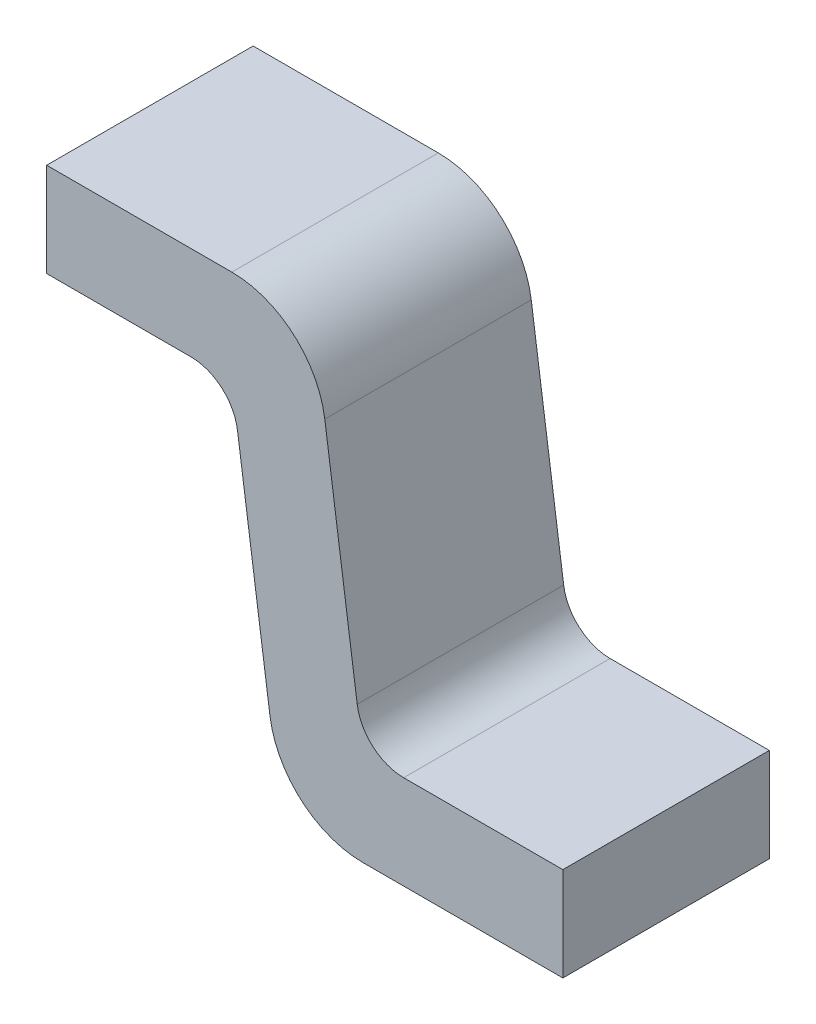
ISO-10303-21;
HEADER;
FILE_DESCRIPTION(('STEP AP214'),'2;1');
FILE_NAME('part.step','',(''),(''),'','','');
FILE_SCHEMA(('AUTOMOTIVE_DESIGN { 1 0 10303 214 1 1 1 1 }'));
ENDSEC;
DATA;
#1=APPLICATION_CONTEXT('core data for automotive mechanical design processes');
#2=APPLICATION_PROTOCOL_DEFINITION('international standard','automotive_design',2000,#1);
#3=PRODUCT_CONTEXT('',#1,'mechanical');
#4=PRODUCT('Part','Part','',(#3));
#5=PRODUCT_RELATED_PRODUCT_CATEGORY('part','',(#4));
#6=PRODUCT_DEFINITION_FORMATION('','',#4);
#7=PRODUCT_DEFINITION_CONTEXT('part definition',#1,'design');
#8=PRODUCT_DEFINITION('design','',#6,#7);
#9=PRODUCT_DEFINITION_SHAPE('','',#8);
#10=(LENGTH_UNIT() NAMED_UNIT(*) SI_UNIT(.MILLI.,.METRE.));
#11=(NAMED_UNIT(*) PLANE_ANGLE_UNIT() SI_UNIT($,.RADIAN.));
#12=(NAMED_UNIT(*) SI_UNIT($,.STERADIAN.) SOLID_ANGLE_UNIT());
#13=UNCERTAINTY_MEASURE_WITH_UNIT(LENGTH_MEASURE(1.E-05),#10,'distance_accuracy_value','');
#14=(GEOMETRIC_REPRESENTATION_CONTEXT(3) GLOBAL_UNCERTAINTY_ASSIGNED_CONTEXT((#13)) GLOBAL_UNIT_ASSIGNED_CONTEXT((#10,
#11,#12)) REPRESENTATION_CONTEXT('',''));
#15=CARTESIAN_POINT('',(0.,0.,0.));
#16=DIRECTION('',(0.,0.,1.));
#17=DIRECTION('',(1.,0.,0.));
#18=AXIS2_PLACEMENT_3D('',#15,#16,#17);
#19=CARTESIAN_POINT('',(1.1,0.,-0.22));
#20=DIRECTION('',(1.,0.,0.));
#21=DIRECTION('',(0.,0.,-1.));
#22=AXIS2_PLACEMENT_3D('',#19,#20,#21);
#23=PLANE('',#22);
#24=DIRECTION('',(0.,0.,1.));
#25=VECTOR('',#24,1.);
#26=CARTESIAN_POINT('',(1.1,0.2,-0.22));
#27=LINE('',#26,#25);
#28=CARTESIAN_POINT('',(1.1,0.2,-0.22));
#29=VERTEX_POINT('',#28);
#30=CARTESIAN_POINT('',(1.1,0.2,0.22));
#31=VERTEX_POINT('',#30);
#32=EDGE_CURVE('E39',#29,#31,#27,.T.);
#33=ORIENTED_EDGE('',*,*,#32,.T.);
#34=DIRECTION('',(0.,1.,0.));
#35=VECTOR('',#34,1.);
#36=CARTESIAN_POINT('',(1.1,0.,0.22));
#37=LINE('',#36,#35);
#38=CARTESIAN_POINT('',(1.1,0.,0.22));
#39=VERTEX_POINT('',#38);
#40=EDGE_CURVE('E124',#39,#31,#37,.T.);
#41=ORIENTED_EDGE('',*,*,#40,.F.);
#42=DIRECTION('',(0.,0.,1.));
#43=VECTOR('',#42,1.);
#44=CARTESIAN_POINT('',(1.1,0.,-0.22));
#45=LINE('',#44,#43);
#46=CARTESIAN_POINT('',(1.1,0.,-0.22));
#47=VERTEX_POINT('',#46);
#48=EDGE_CURVE('E11',#47,#39,#45,.T.);
#49=ORIENTED_EDGE('',*,*,#48,.F.);
#50=DIRECTION('',(0.,1.,0.));
#51=VECTOR('',#50,1.);
#52=CARTESIAN_POINT('',(1.1,0.,-0.22));
#53=LINE('',#52,#51);
#54=EDGE_CURVE('E125',#47,#29,#53,.T.);
#55=ORIENTED_EDGE('',*,*,#54,.T.);
#56=EDGE_LOOP('',(#33,#41,#49,#55));
#57=FACE_BOUND('',#56,.T.);
#58=ADVANCED_FACE('F36',(#57),#23,.T.);
#59=CARTESIAN_POINT('',(0.673857347563247,0.,-0.22));
#60=DIRECTION('',(0.,-1.,0.));
#61=DIRECTION('',(1.,0.,0.));
#62=AXIS2_PLACEMENT_3D('',#59,#60,#61);
#63=PLANE('',#62);
#64=ORIENTED_EDGE('',*,*,#48,.T.);
#65=DIRECTION('',(1.,0.,0.));
#66=VECTOR('',#65,1.);
#67=CARTESIAN_POINT('',(0.673857347563247,0.,0.22));
#68=LINE('',#67,#66);
#69=CARTESIAN_POINT('',(0.673857347563247,0.,0.22));
#70=VERTEX_POINT('',#69);
#71=EDGE_CURVE('E142',#70,#39,#68,.T.);
#72=ORIENTED_EDGE('',*,*,#71,.F.);
#73=DIRECTION('',(0.,0.,1.));
#74=VECTOR('',#73,1.);
#75=CARTESIAN_POINT('',(0.673857347563247,0.,-0.22));
#76=LINE('',#75,#74);
#77=CARTESIAN_POINT('',(0.673857347563247,0.,-0.22));
#78=VERTEX_POINT('',#77);
#79=EDGE_CURVE('E44',#78,#70,#76,.T.);
#80=ORIENTED_EDGE('',*,*,#79,.F.);
#81=DIRECTION('',(1.,0.,0.));
#82=VECTOR('',#81,1.);
#83=CARTESIAN_POINT('',(0.673857347563247,0.,-0.22));
#84=LINE('',#83,#82);
#85=EDGE_CURVE('E130',#78,#47,#84,.T.);
#86=ORIENTED_EDGE('',*,*,#85,.T.);
#87=EDGE_LOOP('',(#64,#72,#80,#86));
#88=FACE_BOUND('',#87,.T.);
#89=ADVANCED_FACE('F254',(#88),#63,.T.);
#90=CARTESIAN_POINT('',(0.673857347563247,0.2,-0.22));
#91=DIRECTION('',(0.,0.,1.));
#92=DIRECTION('',(1.,0.,0.));
#93=AXIS2_PLACEMENT_3D('',#90,#91,#92);
#94=CYLINDRICAL_SURFACE('',#93,0.2);
#95=ORIENTED_EDGE('',*,*,#79,.T.);
#96=CARTESIAN_POINT('',(0.673857347563247,0.2,0.22));
#97=DIRECTION('',(0.,0.,1.));
#98=DIRECTION('',(1.,0.,0.));
#99=AXIS2_PLACEMENT_3D('',#96,#97,#98);
#100=CIRCLE('',#99,0.2);
#101=CARTESIAN_POINT('',(0.475803733814932,0.172165379807988,0.22));
#102=VERTEX_POINT('',#101);
#103=EDGE_CURVE('E167',#102,#70,#100,.T.);
#104=ORIENTED_EDGE('',*,*,#103,.F.);
#105=DIRECTION('',(0.,0.,1.));
#106=VECTOR('',#105,1.);
#107=CARTESIAN_POINT('',(0.475803733814932,0.172165379807988,-0.22));
#108=LINE('',#107,#106);
#109=CARTESIAN_POINT('',(0.475803733814932,0.172165379807988,-0.22));
#110=VERTEX_POINT('',#109);
#111=EDGE_CURVE('E201',#110,#102,#108,.T.);
#112=ORIENTED_EDGE('',*,*,#111,.F.);
#113=CARTESIAN_POINT('',(0.673857347563247,0.2,-0.22));
#114=DIRECTION('',(0.,0.,1.));
#115=DIRECTION('',(1.,0.,0.));
#116=AXIS2_PLACEMENT_3D('',#113,#114,#115);
#117=CIRCLE('',#116,0.2);
#118=EDGE_CURVE('E197',#110,#78,#117,.T.);
#119=ORIENTED_EDGE('',*,*,#118,.T.);
#120=EDGE_LOOP('',(#95,#104,#112,#119));
#121=FACE_BOUND('',#120,.T.);
#122=ADVANCED_FACE('F252',(#121),#94,.T.);
#123=CARTESIAN_POINT('',(0.475803733814932,0.172165379807988,-0.22));
#124=DIRECTION('',(-0.990268068741571,-0.139173100960059,0.));
#125=DIRECTION('',(0.139173100960059,-0.990268068741571,0.));
#126=AXIS2_PLACEMENT_3D('',#123,#124,#125);
#127=PLANE('',#126);
#128=ORIENTED_EDGE('',*,*,#111,.T.);
#129=DIRECTION('',(0.139173100960059,-0.990268068741571,0.));
#130=VECTOR('',#129,1.);
#131=CARTESIAN_POINT('',(0.475803733814932,0.172165379807988,0.22));
#132=LINE('',#131,#130);
#133=CARTESIAN_POINT('',(0.406692507065746,0.663917310096006,0.22));
#134=VERTEX_POINT('',#133);
#135=EDGE_CURVE('E164',#134,#102,#132,.T.);
#136=ORIENTED_EDGE('',*,*,#135,.F.);
#137=DIRECTION('',(0.,0.,1.));
#138=VECTOR('',#137,1.);
#139=CARTESIAN_POINT('',(0.406692507065746,0.663917310096006,-0.22));
#140=LINE('',#139,#138);
#141=CARTESIAN_POINT('',(0.406692507065746,0.663917310096006,-0.22));
#142=VERTEX_POINT('',#141);
#143=EDGE_CURVE('E203',#142,#134,#140,.T.);
#144=ORIENTED_EDGE('',*,*,#143,.F.);
#145=DIRECTION('',(0.139173100960059,-0.990268068741571,0.));
#146=VECTOR('',#145,1.);
#147=CARTESIAN_POINT('',(0.475803733814932,0.172165379807988,-0.22));
#148=LINE('',#147,#146);
#149=EDGE_CURVE('E194',#142,#110,#148,.T.);
#150=ORIENTED_EDGE('',*,*,#149,.T.);
#151=EDGE_LOOP('',(#128,#136,#144,#150));
#152=FACE_BOUND('',#151,.T.);
#153=ADVANCED_FACE('F250',(#152),#127,.T.);
#154=CARTESIAN_POINT('',(0.307665700191588,0.65,-0.22));
#155=DIRECTION('',(0.,0.,1.));
#156=DIRECTION('',(1.,0.,0.));
#157=AXIS2_PLACEMENT_3D('',#154,#155,#156);
#158=CYLINDRICAL_SURFACE('',#157,0.1);
#159=ORIENTED_EDGE('',*,*,#143,.T.);
#160=CARTESIAN_POINT('',(0.307665700191588,0.65,0.22));
#161=DIRECTION('',(0.,0.,-1.));
#162=DIRECTION('',(-1.,0.,0.));
#163=AXIS2_PLACEMENT_3D('',#160,#161,#162);
#164=CIRCLE('',#163,0.1);
#165=CARTESIAN_POINT('',(0.307665700191588,0.75,0.22));
#166=VERTEX_POINT('',#165);
#167=EDGE_CURVE('E161',#166,#134,#164,.T.);
#168=ORIENTED_EDGE('',*,*,#167,.F.);
#169=DIRECTION('',(0.,0.,1.));
#170=VECTOR('',#169,1.);
#171=CARTESIAN_POINT('',(0.307665700191588,0.75,-0.22));
#172=LINE('',#171,#170);
#173=CARTESIAN_POINT('',(0.307665700191588,0.75,-0.22));
#174=VERTEX_POINT('',#173);
#175=EDGE_CURVE('E205',#174,#166,#172,.T.);
#176=ORIENTED_EDGE('',*,*,#175,.F.);
#177=CARTESIAN_POINT('',(0.307665700191588,0.65,-0.22));
#178=DIRECTION('',(0.,0.,-1.));
#179=DIRECTION('',(-1.,0.,0.));
#180=AXIS2_PLACEMENT_3D('',#177,#178,#179);
#181=CIRCLE('',#180,0.1);
#182=EDGE_CURVE('E191',#174,#142,#181,.T.);
#183=ORIENTED_EDGE('',*,*,#182,.T.);
#184=EDGE_LOOP('',(#159,#168,#176,#183));
#185=FACE_BOUND('',#184,.T.);
#186=ADVANCED_FACE('F245',(#185),#158,.F.);
#187=CARTESIAN_POINT('',(0.307665700191588,0.75,-0.22));
#188=DIRECTION('',(0.,-1.,0.));
#189=DIRECTION('',(0.,0.,-1.));
#190=AXIS2_PLACEMENT_3D('',#187,#188,#189);
#191=PLANE('',#190);
#192=ORIENTED_EDGE('',*,*,#175,.T.);
#193=DIRECTION('',(1.,0.,0.));
#194=VECTOR('',#193,1.);
#195=CARTESIAN_POINT('',(0.307665700191588,0.75,0.22));
#196=LINE('',#195,#194);
#197=CARTESIAN_POINT('',(0.,0.75,0.22));
#198=VERTEX_POINT('',#197);
#199=EDGE_CURVE('E158',#198,#166,#196,.T.);
#200=ORIENTED_EDGE('',*,*,#199,.F.);
#201=DIRECTION('',(0.,0.,1.));
#202=VECTOR('',#201,1.);
#203=CARTESIAN_POINT('',(0.,0.75,-0.22));
#204=LINE('',#203,#202);
#205=CARTESIAN_POINT('',(0.,0.75,-0.22));
#206=VERTEX_POINT('',#205);
#207=EDGE_CURVE('E207',#206,#198,#204,.T.);
#208=ORIENTED_EDGE('',*,*,#207,.F.);
#209=DIRECTION('',(1.,0.,0.));
#210=VECTOR('',#209,1.);
#211=CARTESIAN_POINT('',(0.307665700191588,0.75,-0.22));
#212=LINE('',#211,#210);
#213=EDGE_CURVE('E188',#206,#174,#212,.T.);
#214=ORIENTED_EDGE('',*,*,#213,.T.);
#215=EDGE_LOOP('',(#192,#200,#208,#214));
#216=FACE_BOUND('',#215,.T.);
#217=ADVANCED_FACE('F240',(#216),#191,.T.);
#218=CARTESIAN_POINT('',(0.,0.95,-0.22));
#219=DIRECTION('',(-1.,0.,0.));
#220=DIRECTION('',(0.,-1.,0.));
#221=AXIS2_PLACEMENT_3D('',#218,#219,#220);
#222=PLANE('',#221);
#223=ORIENTED_EDGE('',*,*,#207,.T.);
#224=DIRECTION('',(0.,-1.,0.));
#225=VECTOR('',#224,1.);
#226=CARTESIAN_POINT('',(0.,0.95,0.22));
#227=LINE('',#226,#225);
#228=CARTESIAN_POINT('',(0.,0.95,0.22));
#229=VERTEX_POINT('',#228);
#230=EDGE_CURVE('E155',#229,#198,#227,.T.);
#231=ORIENTED_EDGE('',*,*,#230,.F.);
#232=DIRECTION('',(0.,0.,1.));
#233=VECTOR('',#232,1.);
#234=CARTESIAN_POINT('',(0.,0.95,-0.22));
#235=LINE('',#234,#233);
#236=CARTESIAN_POINT('',(0.,0.95,-0.22));
#237=VERTEX_POINT('',#236);
#238=EDGE_CURVE('E209',#237,#229,#235,.T.);
#239=ORIENTED_EDGE('',*,*,#238,.F.);
#240=DIRECTION('',(0.,-1.,0.));
#241=VECTOR('',#240,1.);
#242=CARTESIAN_POINT('',(0.,0.95,-0.22));
#243=LINE('',#242,#241);
#244=EDGE_CURVE('E185',#237,#206,#243,.T.);
#245=ORIENTED_EDGE('',*,*,#244,.T.);
#246=EDGE_LOOP('',(#223,#231,#239,#245));
#247=FACE_BOUND('',#246,.T.);
#248=ADVANCED_FACE('F238',(#247),#222,.T.);
#249=CARTESIAN_POINT('',(0.,0.95,-0.22));
#250=DIRECTION('',(0.,1.,0.));
#251=DIRECTION('',(-1.,0.,0.));
#252=AXIS2_PLACEMENT_3D('',#249,#250,#251);
#253=PLANE('',#252);
#254=ORIENTED_EDGE('',*,*,#238,.T.);
#255=DIRECTION('',(-1.,0.,0.));
#256=VECTOR('',#255,1.);
#257=CARTESIAN_POINT('',(0.,0.95,0.22));
#258=LINE('',#257,#256);
#259=CARTESIAN_POINT('',(0.394594373973212,0.95,0.22));
#260=VERTEX_POINT('',#259);
#261=EDGE_CURVE('E152',#260,#229,#258,.T.);
#262=ORIENTED_EDGE('',*,*,#261,.F.);
#263=DIRECTION('',(0.,0.,1.));
#264=VECTOR('',#263,1.);
#265=CARTESIAN_POINT('',(0.394594373973212,0.95,-0.22));
#266=LINE('',#265,#264);
#267=CARTESIAN_POINT('',(0.394594373973212,0.95,-0.22));
#268=VERTEX_POINT('',#267);
#269=EDGE_CURVE('E211',#268,#260,#266,.T.);
#270=ORIENTED_EDGE('',*,*,#269,.F.);
#271=DIRECTION('',(-1.,0.,0.));
#272=VECTOR('',#271,1.);
#273=CARTESIAN_POINT('',(0.,0.95,-0.22));
#274=LINE('',#273,#272);
#275=EDGE_CURVE('E182',#268,#237,#274,.T.);
#276=ORIENTED_EDGE('',*,*,#275,.T.);
#277=EDGE_LOOP('',(#254,#262,#270,#276));
#278=FACE_BOUND('',#277,.T.);
#279=ADVANCED_FACE('F233',(#278),#253,.T.);
#280=CARTESIAN_POINT('',(0.394594373973212,0.75,-0.22));
#281=DIRECTION('',(0.,0.,1.));
#282=DIRECTION('',(1.,0.,0.));
#283=AXIS2_PLACEMENT_3D('',#280,#281,#282);
#284=CYLINDRICAL_SURFACE('',#283,0.2);
#285=ORIENTED_EDGE('',*,*,#269,.T.);
#286=CARTESIAN_POINT('',(0.394594373973212,0.75,0.22));
#287=DIRECTION('',(0.,0.,1.));
#288=DIRECTION('',(-1.,0.,0.));
#289=AXIS2_PLACEMENT_3D('',#286,#287,#288);
#290=CIRCLE('',#289,0.2);
#291=CARTESIAN_POINT('',(0.592647987721526,0.777834620192012,0.22));
#292=VERTEX_POINT('',#291);
#293=EDGE_CURVE('E149',#292,#260,#290,.T.);
#294=ORIENTED_EDGE('',*,*,#293,.F.);
#295=DIRECTION('',(0.,0.,1.));
#296=VECTOR('',#295,1.);
#297=CARTESIAN_POINT('',(0.592647987721526,0.777834620192012,-0.22));
#298=LINE('',#297,#296);
#299=CARTESIAN_POINT('',(0.592647987721526,0.777834620192012,-0.22));
#300=VERTEX_POINT('',#299);
#301=EDGE_CURVE('E213',#300,#292,#298,.T.);
#302=ORIENTED_EDGE('',*,*,#301,.F.);
#303=CARTESIAN_POINT('',(0.394594373973212,0.75,-0.22));
#304=DIRECTION('',(0.,0.,1.));
#305=DIRECTION('',(-1.,0.,0.));
#306=AXIS2_PLACEMENT_3D('',#303,#304,#305);
#307=CIRCLE('',#306,0.2);
#308=EDGE_CURVE('E179',#300,#268,#307,.T.);
#309=ORIENTED_EDGE('',*,*,#308,.T.);
#310=EDGE_LOOP('',(#285,#294,#302,#309));
#311=FACE_BOUND('',#310,.T.);
#312=ADVANCED_FACE('F226',(#311),#284,.T.);
#313=CARTESIAN_POINT('',(0.592647987721526,0.777834620192012,-0.22));
#314=DIRECTION('',(0.990268068741571,0.139173100960058,0.));
#315=DIRECTION('',(-0.139173100960058,0.990268068741571,0.));
#316=AXIS2_PLACEMENT_3D('',#313,#314,#315);
#317=PLANE('',#316);
#318=ORIENTED_EDGE('',*,*,#301,.T.);
#319=DIRECTION('',(-0.139173100960058,0.990268068741571,0.));
#320=VECTOR('',#319,1.);
#321=CARTESIAN_POINT('',(0.592647987721526,0.777834620192012,0.22));
#322=LINE('',#321,#320);
#323=CARTESIAN_POINT('',(0.661759214470713,0.286082689903994,0.22));
#324=VERTEX_POINT('',#323);
#325=EDGE_CURVE('E146',#324,#292,#322,.T.);
#326=ORIENTED_EDGE('',*,*,#325,.F.);
#327=DIRECTION('',(0.,0.,1.));
#328=VECTOR('',#327,1.);
#329=CARTESIAN_POINT('',(0.661759214470713,0.286082689903994,-0.22));
#330=LINE('',#329,#328);
#331=CARTESIAN_POINT('',(0.661759214470713,0.286082689903994,-0.22));
#332=VERTEX_POINT('',#331);
#333=EDGE_CURVE('E215',#332,#324,#330,.T.);
#334=ORIENTED_EDGE('',*,*,#333,.F.);
#335=DIRECTION('',(-0.139173100960058,0.990268068741571,0.));
#336=VECTOR('',#335,1.);
#337=CARTESIAN_POINT('',(0.592647987721526,0.777834620192012,-0.22));
#338=LINE('',#337,#336);
#339=EDGE_CURVE('E176',#332,#300,#338,.T.);
#340=ORIENTED_EDGE('',*,*,#339,.T.);
#341=EDGE_LOOP('',(#318,#326,#334,#340));
#342=FACE_BOUND('',#341,.T.);
#343=ADVANCED_FACE('F223',(#342),#317,.T.);
#344=CARTESIAN_POINT('',(0.76078602134487,0.3,-0.22));
#345=DIRECTION('',(0.,0.,1.));
#346=DIRECTION('',(1.,0.,0.));
#347=AXIS2_PLACEMENT_3D('',#344,#345,#346);
#348=CYLINDRICAL_SURFACE('',#347,0.1);
#349=ORIENTED_EDGE('',*,*,#333,.T.);
#350=CARTESIAN_POINT('',(0.76078602134487,0.3,0.22));
#351=DIRECTION('',(0.,0.,-1.));
#352=DIRECTION('',(-1.,0.,0.));
#353=AXIS2_PLACEMENT_3D('',#350,#351,#352);
#354=CIRCLE('',#353,0.1);
#355=CARTESIAN_POINT('',(0.76078602134487,0.2,0.22));
#356=VERTEX_POINT('',#355);
#357=EDGE_CURVE('E137',#356,#324,#354,.T.);
#358=ORIENTED_EDGE('',*,*,#357,.F.);
#359=DIRECTION('',(0.,0.,1.));
#360=VECTOR('',#359,1.);
#361=CARTESIAN_POINT('',(0.76078602134487,0.2,-0.22));
#362=LINE('',#361,#360);
#363=CARTESIAN_POINT('',(0.76078602134487,0.2,-0.22));
#364=VERTEX_POINT('',#363);
#365=EDGE_CURVE('E129',#364,#356,#362,.T.);
#366=ORIENTED_EDGE('',*,*,#365,.F.);
#367=CARTESIAN_POINT('',(0.76078602134487,0.3,-0.22));
#368=DIRECTION('',(0.,0.,-1.));
#369=DIRECTION('',(-1.,0.,0.));
#370=AXIS2_PLACEMENT_3D('',#367,#368,#369);
#371=CIRCLE('',#370,0.1);
#372=EDGE_CURVE('E173',#364,#332,#371,.T.);
#373=ORIENTED_EDGE('',*,*,#372,.T.);
#374=EDGE_LOOP('',(#349,#358,#366,#373));
#375=FACE_BOUND('',#374,.T.);
#376=ADVANCED_FACE('F217',(#375),#348,.F.);
#377=CARTESIAN_POINT('',(1.1,0.2,-0.22));
#378=DIRECTION('',(0.,1.,0.));
#379=DIRECTION('',(-1.,0.,0.));
#380=AXIS2_PLACEMENT_3D('',#377,#378,#379);
#381=PLANE('',#380);
#382=ORIENTED_EDGE('',*,*,#365,.T.);
#383=DIRECTION('',(-1.,0.,0.));
#384=VECTOR('',#383,1.);
#385=CARTESIAN_POINT('',(1.1,0.2,0.22));
#386=LINE('',#385,#384);
#387=EDGE_CURVE('E132',#31,#356,#386,.T.);
#388=ORIENTED_EDGE('',*,*,#387,.F.);
#389=ORIENTED_EDGE('',*,*,#32,.F.);
#390=DIRECTION('',(-1.,0.,0.));
#391=VECTOR('',#390,1.);
#392=CARTESIAN_POINT('',(1.1,0.2,-0.22));
#393=LINE('',#392,#391);
#394=EDGE_CURVE('E171',#29,#364,#393,.T.);
#395=ORIENTED_EDGE('',*,*,#394,.T.);
#396=EDGE_LOOP('',(#382,#388,#389,#395));
#397=FACE_BOUND('',#396,.T.);
#398=ADVANCED_FACE('F133',(#397),#381,.T.);
#399=CARTESIAN_POINT('',(0.76078602134487,0.3,-0.22));
#400=DIRECTION('',(0.,0.,-1.));
#401=DIRECTION('',(-1.,0.,0.));
#402=AXIS2_PLACEMENT_3D('',#399,#400,#401);
#403=PLANE('',#402);
#404=ORIENTED_EDGE('',*,*,#54,.F.);
#405=ORIENTED_EDGE('',*,*,#85,.F.);
#406=ORIENTED_EDGE('',*,*,#118,.F.);
#407=ORIENTED_EDGE('',*,*,#149,.F.);
#408=ORIENTED_EDGE('',*,*,#182,.F.);
#409=ORIENTED_EDGE('',*,*,#213,.F.);
#410=ORIENTED_EDGE('',*,*,#244,.F.);
#411=ORIENTED_EDGE('',*,*,#275,.F.);
#412=ORIENTED_EDGE('',*,*,#308,.F.);
#413=ORIENTED_EDGE('',*,*,#339,.F.);
#414=ORIENTED_EDGE('',*,*,#372,.F.);
#415=ORIENTED_EDGE('',*,*,#394,.F.);
#416=EDGE_LOOP('',(#404,#405,#406,#407,#408,#409,#410,#411,#412,#413,#414,#415));
#417=FACE_BOUND('',#416,.T.);
#418=ADVANCED_FACE('F229',(#417),#403,.T.);
#419=CARTESIAN_POINT('',(0.76078602134487,0.3,0.22));
#420=DIRECTION('',(0.,0.,-1.));
#421=DIRECTION('',(-1.,0.,0.));
#422=AXIS2_PLACEMENT_3D('',#419,#420,#421);
#423=PLANE('',#422);
#424=ORIENTED_EDGE('',*,*,#40,.T.);
#425=ORIENTED_EDGE('',*,*,#387,.T.);
#426=ORIENTED_EDGE('',*,*,#357,.T.);
#427=ORIENTED_EDGE('',*,*,#325,.T.);
#428=ORIENTED_EDGE('',*,*,#293,.T.);
#429=ORIENTED_EDGE('',*,*,#261,.T.);
#430=ORIENTED_EDGE('',*,*,#230,.T.);
#431=ORIENTED_EDGE('',*,*,#199,.T.);
#432=ORIENTED_EDGE('',*,*,#167,.T.);
#433=ORIENTED_EDGE('',*,*,#135,.T.);
#434=ORIENTED_EDGE('',*,*,#103,.T.);
#435=ORIENTED_EDGE('',*,*,#71,.T.);
#436=EDGE_LOOP('',(#424,#425,#426,#427,#428,#429,#430,#431,#432,#433,#434,#435));
#437=FACE_BOUND('',#436,.T.);
#438=ADVANCED_FACE('F140',(#437),#423,.F.);
#439=CLOSED_SHELL('',(#58,#89,#122,#153,#186,#217,#248,#279,#312,#343,#376,#398,#418,#438));
#440=MANIFOLD_SOLID_BREP('B2',#439);
#441=ADVANCED_BREP_SHAPE_REPRESENTATION('',(#18,#440),#14);
#442=SHAPE_DEFINITION_REPRESENTATION(#9,#441);
ENDSEC;
END-ISO-10303-21;
